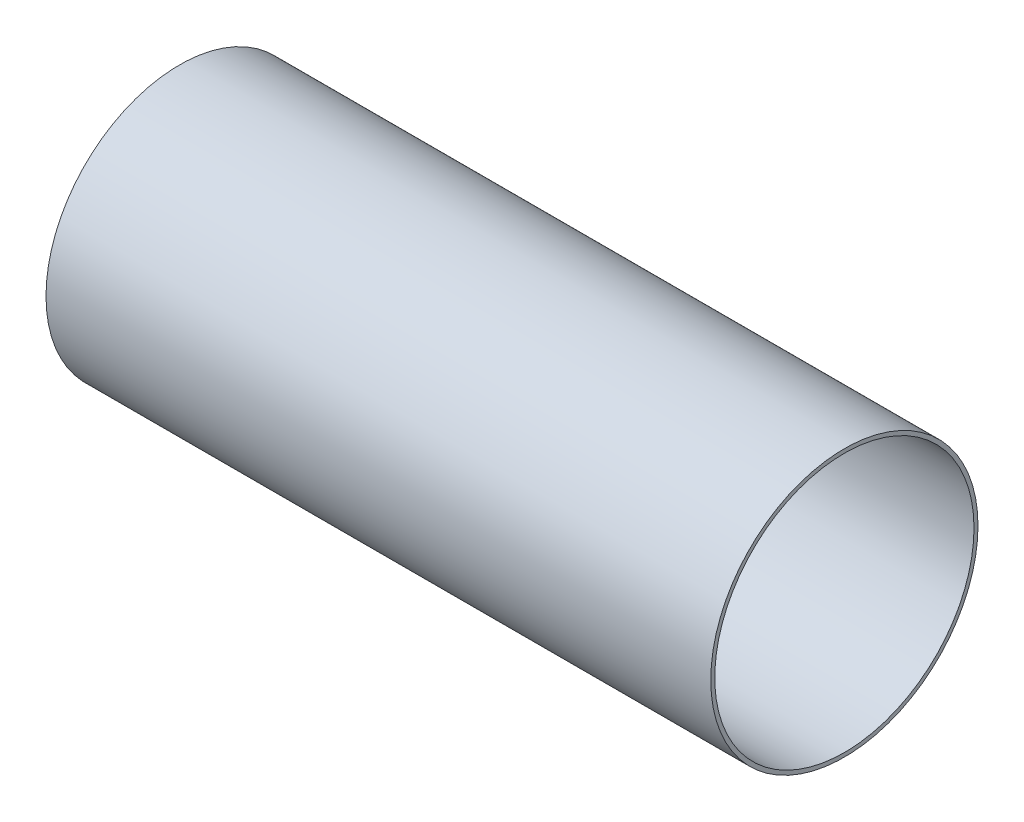
ISO-10303-21;
HEADER;
FILE_DESCRIPTION(('STEP AP214'),'2;1');
FILE_NAME('part.step','',(''),(''),'','','');
FILE_SCHEMA(('AUTOMOTIVE_DESIGN { 1 0 10303 214 1 1 1 1 }'));
ENDSEC;
DATA;
#1=APPLICATION_CONTEXT('core data for automotive mechanical design processes');
#2=APPLICATION_PROTOCOL_DEFINITION('international standard','automotive_design',2000,#1);
#3=PRODUCT_CONTEXT('',#1,'mechanical');
#4=PRODUCT('Part','Part','',(#3));
#5=PRODUCT_RELATED_PRODUCT_CATEGORY('part','',(#4));
#6=PRODUCT_DEFINITION_FORMATION('','',#4);
#7=PRODUCT_DEFINITION_CONTEXT('part definition',#1,'design');
#8=PRODUCT_DEFINITION('design','',#6,#7);
#9=PRODUCT_DEFINITION_SHAPE('','',#8);
#10=(LENGTH_UNIT() NAMED_UNIT(*) SI_UNIT(.MILLI.,.METRE.));
#11=(NAMED_UNIT(*) PLANE_ANGLE_UNIT() SI_UNIT($,.RADIAN.));
#12=(NAMED_UNIT(*) SI_UNIT($,.STERADIAN.) SOLID_ANGLE_UNIT());
#13=UNCERTAINTY_MEASURE_WITH_UNIT(LENGTH_MEASURE(1.E-05),#10,'distance_accuracy_value','');
#14=(GEOMETRIC_REPRESENTATION_CONTEXT(3) GLOBAL_UNCERTAINTY_ASSIGNED_CONTEXT((#13)) GLOBAL_UNIT_ASSIGNED_CONTEXT((#10,
#11,#12)) REPRESENTATION_CONTEXT('',''));
#15=CARTESIAN_POINT('',(0.,0.,0.));
#16=DIRECTION('',(0.,0.,1.));
#17=DIRECTION('',(1.,0.,0.));
#18=AXIS2_PLACEMENT_3D('',#15,#16,#17);
#19=CARTESIAN_POINT('',(-127.,0.,0.));
#20=DIRECTION('',(1.,0.,0.));
#21=DIRECTION('',(0.,0.,-1.));
#22=AXIS2_PLACEMENT_3D('',#19,#20,#21);
#23=CYLINDRICAL_SURFACE('',#22,51.054);
#24=CARTESIAN_POINT('',(-127.,0.,0.));
#25=DIRECTION('',(1.,0.,0.));
#26=DIRECTION('',(0.,0.,-1.));
#27=AXIS2_PLACEMENT_3D('',#24,#25,#26);
#28=CIRCLE('',#27,51.054);
#29=CARTESIAN_POINT('',(-127.,0.,-51.054));
#30=VERTEX_POINT('',#29);
#31=EDGE_CURVE('E10',#30,#30,#28,.T.);
#32=ORIENTED_EDGE('',*,*,#31,.T.);
#33=EDGE_LOOP('',(#32));
#34=FACE_BOUND('',#33,.T.);
#35=CARTESIAN_POINT('',(127.,0.,0.));
#36=DIRECTION('',(1.,0.,0.));
#37=DIRECTION('',(0.,0.,-1.));
#38=AXIS2_PLACEMENT_3D('',#35,#36,#37);
#39=CIRCLE('',#38,51.054);
#40=CARTESIAN_POINT('',(127.,0.,-51.054));
#41=VERTEX_POINT('',#40);
#42=EDGE_CURVE('E49',#41,#41,#39,.T.);
#43=ORIENTED_EDGE('',*,*,#42,.F.);
#44=EDGE_LOOP('',(#43));
#45=FACE_BOUND('',#44,.T.);
#46=ADVANCED_FACE('F39',(#34,#45),#23,.T.);
#47=CARTESIAN_POINT('',(-127.,0.,0.));
#48=DIRECTION('',(1.,0.,0.));
#49=DIRECTION('',(0.,0.,-1.));
#50=AXIS2_PLACEMENT_3D('',#47,#48,#49);
#51=PLANE('',#50);
#52=CARTESIAN_POINT('',(-127.,0.,0.));
#53=DIRECTION('',(1.,0.,0.));
#54=DIRECTION('',(0.,0.,-1.));
#55=AXIS2_PLACEMENT_3D('',#52,#53,#54);
#56=CIRCLE('',#55,49.53);
#57=CARTESIAN_POINT('',(-127.,0.,-49.53));
#58=VERTEX_POINT('',#57);
#59=EDGE_CURVE('E45',#58,#58,#56,.T.);
#60=ORIENTED_EDGE('',*,*,#59,.T.);
#61=EDGE_LOOP('',(#60));
#62=FACE_BOUND('',#61,.T.);
#63=ORIENTED_EDGE('',*,*,#31,.F.);
#64=EDGE_LOOP('',(#63));
#65=FACE_BOUND('',#64,.T.);
#66=ADVANCED_FACE('F68',(#62,#65),#51,.F.);
#67=CARTESIAN_POINT('',(-127.,0.,0.));
#68=DIRECTION('',(1.,0.,0.));
#69=DIRECTION('',(0.,0.,-1.));
#70=AXIS2_PLACEMENT_3D('',#67,#68,#69);
#71=CYLINDRICAL_SURFACE('',#70,49.53);
#72=ORIENTED_EDGE('',*,*,#59,.F.);
#73=EDGE_LOOP('',(#72));
#74=FACE_BOUND('',#73,.T.);
#75=CARTESIAN_POINT('',(127.,0.,0.));
#76=DIRECTION('',(1.,0.,0.));
#77=DIRECTION('',(0.,0.,-1.));
#78=AXIS2_PLACEMENT_3D('',#75,#76,#77);
#79=CIRCLE('',#78,49.53);
#80=CARTESIAN_POINT('',(127.,0.,-49.53));
#81=VERTEX_POINT('',#80);
#82=EDGE_CURVE('E53',#81,#81,#79,.T.);
#83=ORIENTED_EDGE('',*,*,#82,.T.);
#84=EDGE_LOOP('',(#83));
#85=FACE_BOUND('',#84,.T.);
#86=ADVANCED_FACE('F59',(#74,#85),#71,.F.);
#87=CARTESIAN_POINT('',(127.,0.,0.));
#88=DIRECTION('',(1.,0.,0.));
#89=DIRECTION('',(0.,0.,-1.));
#90=AXIS2_PLACEMENT_3D('',#87,#88,#89);
#91=PLANE('',#90);
#92=ORIENTED_EDGE('',*,*,#42,.T.);
#93=EDGE_LOOP('',(#92));
#94=FACE_BOUND('',#93,.T.);
#95=ORIENTED_EDGE('',*,*,#82,.F.);
#96=EDGE_LOOP('',(#95));
#97=FACE_BOUND('',#96,.T.);
#98=ADVANCED_FACE('F61',(#94,#97),#91,.T.);
#99=CLOSED_SHELL('',(#46,#66,#86,#98));
#100=MANIFOLD_SOLID_BREP('B2',#99);
#101=ADVANCED_BREP_SHAPE_REPRESENTATION('',(#18,#100),#14);
#102=SHAPE_DEFINITION_REPRESENTATION(#9,#101);
ENDSEC;
END-ISO-10303-21;
